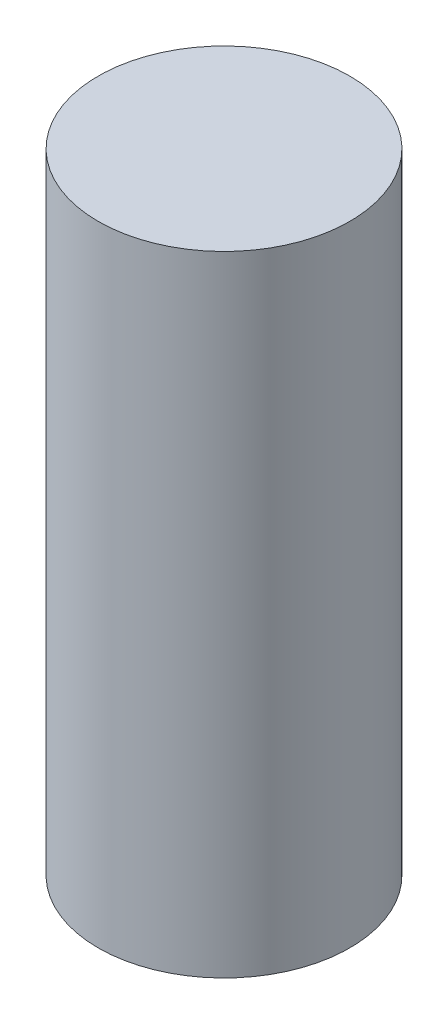
ISO-10303-21;
HEADER;
FILE_DESCRIPTION(('STEP AP214'),'2;1');
FILE_NAME('part.step','',(''),(''),'','','');
FILE_SCHEMA(('AUTOMOTIVE_DESIGN { 1 0 10303 214 1 1 1 1 }'));
ENDSEC;
DATA;
#1=APPLICATION_CONTEXT('core data for automotive mechanical design processes');
#2=APPLICATION_PROTOCOL_DEFINITION('international standard','automotive_design',2000,#1);
#3=PRODUCT_CONTEXT('',#1,'mechanical');
#4=PRODUCT('Part','Part','',(#3));
#5=PRODUCT_RELATED_PRODUCT_CATEGORY('part','',(#4));
#6=PRODUCT_DEFINITION_FORMATION('','',#4);
#7=PRODUCT_DEFINITION_CONTEXT('part definition',#1,'design');
#8=PRODUCT_DEFINITION('design','',#6,#7);
#9=PRODUCT_DEFINITION_SHAPE('','',#8);
#10=(LENGTH_UNIT() NAMED_UNIT(*) SI_UNIT(.MILLI.,.METRE.));
#11=(NAMED_UNIT(*) PLANE_ANGLE_UNIT() SI_UNIT($,.RADIAN.));
#12=(NAMED_UNIT(*) SI_UNIT($,.STERADIAN.) SOLID_ANGLE_UNIT());
#13=UNCERTAINTY_MEASURE_WITH_UNIT(LENGTH_MEASURE(1.E-05),#10,'distance_accuracy_value','');
#14=(GEOMETRIC_REPRESENTATION_CONTEXT(3) GLOBAL_UNCERTAINTY_ASSIGNED_CONTEXT((#13)) GLOBAL_UNIT_ASSIGNED_CONTEXT((#10,
#11,#12)) REPRESENTATION_CONTEXT('',''));
#15=CARTESIAN_POINT('',(0.,0.,0.));
#16=DIRECTION('',(0.,0.,1.));
#17=DIRECTION('',(1.,0.,0.));
#18=AXIS2_PLACEMENT_3D('',#15,#16,#17);
#19=CARTESIAN_POINT('',(0.,10.,0.));
#20=DIRECTION('',(0.,-1.,0.));
#21=DIRECTION('',(0.,0.,-1.));
#22=AXIS2_PLACEMENT_3D('',#19,#20,#21);
#23=CYLINDRICAL_SURFACE('',#22,2.);
#24=CARTESIAN_POINT('',(0.,10.,0.));
#25=DIRECTION('',(0.,1.,0.));
#26=DIRECTION('',(0.,0.,1.));
#27=AXIS2_PLACEMENT_3D('',#24,#25,#26);
#28=CIRCLE('',#27,2.);
#29=CARTESIAN_POINT('',(0.,10.,2.));
#30=VERTEX_POINT('',#29);
#31=EDGE_CURVE('E10',#30,#30,#28,.T.);
#32=ORIENTED_EDGE('',*,*,#31,.F.);
#33=EDGE_LOOP('',(#32));
#34=FACE_BOUND('',#33,.T.);
#35=CARTESIAN_POINT('',(0.,0.,0.));
#36=DIRECTION('',(0.,1.,0.));
#37=DIRECTION('',(0.,0.,1.));
#38=AXIS2_PLACEMENT_3D('',#35,#36,#37);
#39=CIRCLE('',#38,2.);
#40=CARTESIAN_POINT('',(0.,0.,2.));
#41=VERTEX_POINT('',#40);
#42=EDGE_CURVE('E34',#41,#41,#39,.T.);
#43=ORIENTED_EDGE('',*,*,#42,.T.);
#44=EDGE_LOOP('',(#43));
#45=FACE_BOUND('',#44,.T.);
#46=ADVANCED_FACE('F31',(#34,#45),#23,.T.);
#47=CARTESIAN_POINT('',(0.,10.,0.));
#48=DIRECTION('',(0.,1.,0.));
#49=DIRECTION('',(0.,0.,1.));
#50=AXIS2_PLACEMENT_3D('',#47,#48,#49);
#51=PLANE('',#50);
#52=ORIENTED_EDGE('',*,*,#31,.T.);
#53=EDGE_LOOP('',(#52));
#54=FACE_BOUND('',#53,.T.);
#55=ADVANCED_FACE('F46',(#54),#51,.T.);
#56=CARTESIAN_POINT('',(0.,0.,0.));
#57=DIRECTION('',(0.,1.,0.));
#58=DIRECTION('',(0.,0.,1.));
#59=AXIS2_PLACEMENT_3D('',#56,#57,#58);
#60=PLANE('',#59);
#61=ORIENTED_EDGE('',*,*,#42,.F.);
#62=EDGE_LOOP('',(#61));
#63=FACE_BOUND('',#62,.T.);
#64=ADVANCED_FACE('F44',(#63),#60,.F.);
#65=CLOSED_SHELL('',(#46,#55,#64));
#66=MANIFOLD_SOLID_BREP('B2',#65);
#67=ADVANCED_BREP_SHAPE_REPRESENTATION('',(#18,#66),#14);
#68=SHAPE_DEFINITION_REPRESENTATION(#9,#67);
ENDSEC;
END-ISO-10303-21;
